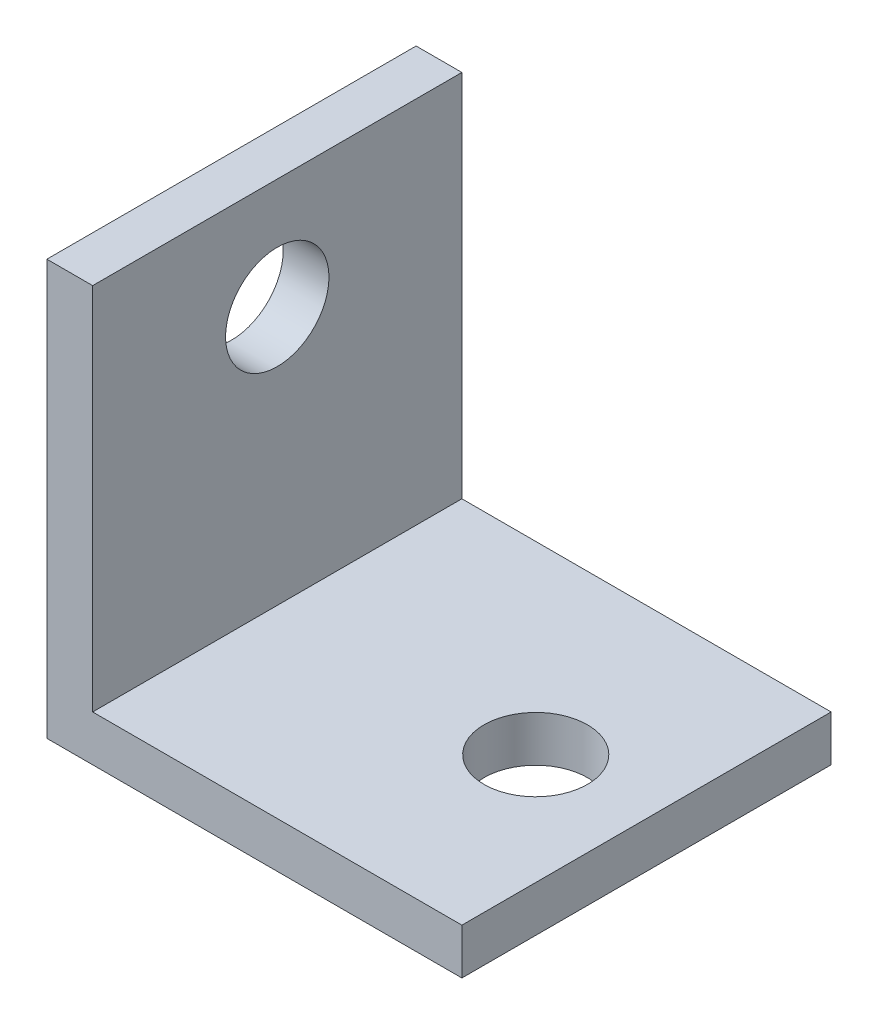
ISO-10303-21;
HEADER;
FILE_DESCRIPTION(('STEP AP214'),'2;1');
FILE_NAME('part.step','',(''),(''),'','','');
FILE_SCHEMA(('AUTOMOTIVE_DESIGN { 1 0 10303 214 1 1 1 1 }'));
ENDSEC;
DATA;
#1=APPLICATION_CONTEXT('core data for automotive mechanical design processes');
#2=APPLICATION_PROTOCOL_DEFINITION('international standard','automotive_design',2000,#1);
#3=PRODUCT_CONTEXT('',#1,'mechanical');
#4=PRODUCT('Part','Part','',(#3));
#5=PRODUCT_RELATED_PRODUCT_CATEGORY('part','',(#4));
#6=PRODUCT_DEFINITION_FORMATION('','',#4);
#7=PRODUCT_DEFINITION_CONTEXT('part definition',#1,'design');
#8=PRODUCT_DEFINITION('design','',#6,#7);
#9=PRODUCT_DEFINITION_SHAPE('','',#8);
#10=(LENGTH_UNIT() NAMED_UNIT(*) SI_UNIT(.MILLI.,.METRE.));
#11=(NAMED_UNIT(*) PLANE_ANGLE_UNIT() SI_UNIT($,.RADIAN.));
#12=(NAMED_UNIT(*) SI_UNIT($,.STERADIAN.) SOLID_ANGLE_UNIT());
#13=UNCERTAINTY_MEASURE_WITH_UNIT(LENGTH_MEASURE(1.E-05),#10,'distance_accuracy_value','');
#14=(GEOMETRIC_REPRESENTATION_CONTEXT(3) GLOBAL_UNCERTAINTY_ASSIGNED_CONTEXT((#13)) GLOBAL_UNIT_ASSIGNED_CONTEXT((#10,
#11,#12)) REPRESENTATION_CONTEXT('',''));
#15=CARTESIAN_POINT('',(0.,0.,0.));
#16=DIRECTION('',(0.,0.,1.));
#17=DIRECTION('',(1.,0.,0.));
#18=AXIS2_PLACEMENT_3D('',#15,#16,#17);
#19=CARTESIAN_POINT('',(0.,1.5748,12.7));
#20=DIRECTION('',(-1.,0.,0.));
#21=DIRECTION('',(0.,0.,1.));
#22=AXIS2_PLACEMENT_3D('',#19,#20,#21);
#23=PLANE('',#22);
#24=DIRECTION('',(0.,1.,0.));
#25=VECTOR('',#24,1.);
#26=CARTESIAN_POINT('',(0.,1.5748,0.));
#27=LINE('',#26,#25);
#28=CARTESIAN_POINT('',(0.,0.,0.));
#29=VERTEX_POINT('',#28);
#30=CARTESIAN_POINT('',(0.,1.5748,0.));
#31=VERTEX_POINT('',#30);
#32=EDGE_CURVE('E87',#29,#31,#27,.T.);
#33=ORIENTED_EDGE('',*,*,#32,.T.);
#34=DIRECTION('',(0.,0.,-1.));
#35=VECTOR('',#34,1.);
#36=CARTESIAN_POINT('',(0.,1.5748,12.7));
#37=LINE('',#36,#35);
#38=CARTESIAN_POINT('',(0.,1.5748,12.7));
#39=VERTEX_POINT('',#38);
#40=EDGE_CURVE('E11',#39,#31,#37,.T.);
#41=ORIENTED_EDGE('',*,*,#40,.F.);
#42=DIRECTION('',(0.,1.,0.));
#43=VECTOR('',#42,1.);
#44=CARTESIAN_POINT('',(0.,1.5748,12.7));
#45=LINE('',#44,#43);
#46=CARTESIAN_POINT('',(0.,0.,12.7));
#47=VERTEX_POINT('',#46);
#48=EDGE_CURVE('E115',#47,#39,#45,.T.);
#49=ORIENTED_EDGE('',*,*,#48,.F.);
#50=DIRECTION('',(0.,0.,-1.));
#51=VECTOR('',#50,1.);
#52=CARTESIAN_POINT('',(0.,0.,12.7));
#53=LINE('',#52,#51);
#54=EDGE_CURVE('E100',#47,#29,#53,.T.);
#55=ORIENTED_EDGE('',*,*,#54,.T.);
#56=EDGE_LOOP('',(#33,#41,#49,#55));
#57=FACE_BOUND('',#56,.T.);
#58=ADVANCED_FACE('F29',(#57),#23,.F.);
#59=CARTESIAN_POINT('',(-12.7,1.5748,12.7));
#60=DIRECTION('',(0.,-1.,0.));
#61=DIRECTION('',(1.,0.,0.));
#62=AXIS2_PLACEMENT_3D('',#59,#60,#61);
#63=PLANE('',#62);
#64=CARTESIAN_POINT('',(-3.81,1.5748,6.35));
#65=DIRECTION('',(0.,1.,0.));
#66=DIRECTION('',(-1.,0.,0.));
#67=AXIS2_PLACEMENT_3D('',#64,#65,#66);
#68=CIRCLE('',#67,1.778);
#69=CARTESIAN_POINT('',(-5.588,1.5748,6.35));
#70=VERTEX_POINT('',#69);
#71=EDGE_CURVE('E231',#70,#70,#68,.T.);
#72=ORIENTED_EDGE('',*,*,#71,.F.);
#73=EDGE_LOOP('',(#72));
#74=FACE_BOUND('',#73,.T.);
#75=DIRECTION('',(-1.,0.,0.));
#76=VECTOR('',#75,1.);
#77=CARTESIAN_POINT('',(-12.7,1.5748,0.));
#78=LINE('',#77,#76);
#79=CARTESIAN_POINT('',(-12.7,1.5748,0.));
#80=VERTEX_POINT('',#79);
#81=EDGE_CURVE('E83',#31,#80,#78,.T.);
#82=ORIENTED_EDGE('',*,*,#81,.T.);
#83=DIRECTION('',(0.,0.,-1.));
#84=VECTOR('',#83,1.);
#85=CARTESIAN_POINT('',(-12.7,1.5748,12.7));
#86=LINE('',#85,#84);
#87=CARTESIAN_POINT('',(-12.7,1.5748,12.7));
#88=VERTEX_POINT('',#87);
#89=EDGE_CURVE('E37',#88,#80,#86,.T.);
#90=ORIENTED_EDGE('',*,*,#89,.F.);
#91=DIRECTION('',(-1.,0.,0.));
#92=VECTOR('',#91,1.);
#93=CARTESIAN_POINT('',(-12.7,1.5748,12.7));
#94=LINE('',#93,#92);
#95=EDGE_CURVE('E96',#39,#88,#94,.T.);
#96=ORIENTED_EDGE('',*,*,#95,.F.);
#97=ORIENTED_EDGE('',*,*,#40,.T.);
#98=EDGE_LOOP('',(#82,#90,#96,#97));
#99=FACE_BOUND('',#98,.T.);
#100=ADVANCED_FACE('F95',(#74,#99),#63,.F.);
#101=CARTESIAN_POINT('',(-12.7,14.2748,12.7));
#102=DIRECTION('',(-1.,0.,0.));
#103=DIRECTION('',(0.,0.,1.));
#104=AXIS2_PLACEMENT_3D('',#101,#102,#103);
#105=PLANE('',#104);
#106=CARTESIAN_POINT('',(-12.7,10.4648,6.35));
#107=DIRECTION('',(1.,0.,0.));
#108=DIRECTION('',(0.,0.,-1.));
#109=AXIS2_PLACEMENT_3D('',#106,#107,#108);
#110=CIRCLE('',#109,1.778);
#111=CARTESIAN_POINT('',(-12.7,10.4648,4.572));
#112=VERTEX_POINT('',#111);
#113=EDGE_CURVE('E104',#112,#112,#110,.T.);
#114=ORIENTED_EDGE('',*,*,#113,.F.);
#115=EDGE_LOOP('',(#114));
#116=FACE_BOUND('',#115,.T.);
#117=DIRECTION('',(0.,1.,0.));
#118=VECTOR('',#117,1.);
#119=CARTESIAN_POINT('',(-12.7,14.2748,0.));
#120=LINE('',#119,#118);
#121=CARTESIAN_POINT('',(-12.7,14.2748,0.));
#122=VERTEX_POINT('',#121);
#123=EDGE_CURVE('E89',#80,#122,#120,.T.);
#124=ORIENTED_EDGE('',*,*,#123,.T.);
#125=DIRECTION('',(0.,0.,-1.));
#126=VECTOR('',#125,1.);
#127=CARTESIAN_POINT('',(-12.7,14.2748,12.7));
#128=LINE('',#127,#126);
#129=CARTESIAN_POINT('',(-12.7,14.2748,12.7));
#130=VERTEX_POINT('',#129);
#131=EDGE_CURVE('E131',#130,#122,#128,.T.);
#132=ORIENTED_EDGE('',*,*,#131,.F.);
#133=DIRECTION('',(0.,1.,0.));
#134=VECTOR('',#133,1.);
#135=CARTESIAN_POINT('',(-12.7,14.2748,12.7));
#136=LINE('',#135,#134);
#137=EDGE_CURVE('E118',#88,#130,#136,.T.);
#138=ORIENTED_EDGE('',*,*,#137,.F.);
#139=ORIENTED_EDGE('',*,*,#89,.T.);
#140=EDGE_LOOP('',(#124,#132,#138,#139));
#141=FACE_BOUND('',#140,.T.);
#142=ADVANCED_FACE('F136',(#116,#141),#105,.F.);
#143=CARTESIAN_POINT('',(-14.2748,14.2748,12.7));
#144=DIRECTION('',(0.,-1.,0.));
#145=DIRECTION('',(0.,0.,-1.));
#146=AXIS2_PLACEMENT_3D('',#143,#144,#145);
#147=PLANE('',#146);
#148=DIRECTION('',(-1.,0.,0.));
#149=VECTOR('',#148,1.);
#150=CARTESIAN_POINT('',(-14.2748,14.2748,0.));
#151=LINE('',#150,#149);
#152=CARTESIAN_POINT('',(-14.2748,14.2748,0.));
#153=VERTEX_POINT('',#152);
#154=EDGE_CURVE('E109',#122,#153,#151,.T.);
#155=ORIENTED_EDGE('',*,*,#154,.T.);
#156=DIRECTION('',(0.,0.,-1.));
#157=VECTOR('',#156,1.);
#158=CARTESIAN_POINT('',(-14.2748,14.2748,12.7));
#159=LINE('',#158,#157);
#160=CARTESIAN_POINT('',(-14.2748,14.2748,12.7));
#161=VERTEX_POINT('',#160);
#162=EDGE_CURVE('E128',#161,#153,#159,.T.);
#163=ORIENTED_EDGE('',*,*,#162,.F.);
#164=DIRECTION('',(-1.,0.,0.));
#165=VECTOR('',#164,1.);
#166=CARTESIAN_POINT('',(-14.2748,14.2748,12.7));
#167=LINE('',#166,#165);
#168=EDGE_CURVE('E120',#130,#161,#167,.T.);
#169=ORIENTED_EDGE('',*,*,#168,.F.);
#170=ORIENTED_EDGE('',*,*,#131,.T.);
#171=EDGE_LOOP('',(#155,#163,#169,#170));
#172=FACE_BOUND('',#171,.T.);
#173=ADVANCED_FACE('F142',(#172),#147,.F.);
#174=CARTESIAN_POINT('',(-14.2748,0.,12.7));
#175=DIRECTION('',(1.,0.,0.));
#176=DIRECTION('',(0.,0.,-1.));
#177=AXIS2_PLACEMENT_3D('',#174,#175,#176);
#178=PLANE('',#177);
#179=CARTESIAN_POINT('',(-14.2748,10.4648,6.35));
#180=DIRECTION('',(1.,0.,0.));
#181=DIRECTION('',(0.,0.,-1.));
#182=AXIS2_PLACEMENT_3D('',#179,#180,#181);
#183=CIRCLE('',#182,1.778);
#184=CARTESIAN_POINT('',(-14.2748,10.4648,4.572));
#185=VERTEX_POINT('',#184);
#186=EDGE_CURVE('E101',#185,#185,#183,.T.);
#187=ORIENTED_EDGE('',*,*,#186,.T.);
#188=EDGE_LOOP('',(#187));
#189=FACE_BOUND('',#188,.T.);
#190=DIRECTION('',(0.,-1.,0.));
#191=VECTOR('',#190,1.);
#192=CARTESIAN_POINT('',(-14.2748,0.,0.));
#193=LINE('',#192,#191);
#194=CARTESIAN_POINT('',(-14.2748,0.,0.));
#195=VERTEX_POINT('',#194);
#196=EDGE_CURVE('E111',#153,#195,#193,.T.);
#197=ORIENTED_EDGE('',*,*,#196,.T.);
#198=DIRECTION('',(0.,0.,-1.));
#199=VECTOR('',#198,1.);
#200=CARTESIAN_POINT('',(-14.2748,0.,12.7));
#201=LINE('',#200,#199);
#202=CARTESIAN_POINT('',(-14.2748,0.,12.7));
#203=VERTEX_POINT('',#202);
#204=EDGE_CURVE('E125',#203,#195,#201,.T.);
#205=ORIENTED_EDGE('',*,*,#204,.F.);
#206=DIRECTION('',(0.,-1.,0.));
#207=VECTOR('',#206,1.);
#208=CARTESIAN_POINT('',(-14.2748,0.,12.7));
#209=LINE('',#208,#207);
#210=EDGE_CURVE('E50',#161,#203,#209,.T.);
#211=ORIENTED_EDGE('',*,*,#210,.F.);
#212=ORIENTED_EDGE('',*,*,#162,.T.);
#213=EDGE_LOOP('',(#197,#205,#211,#212));
#214=FACE_BOUND('',#213,.T.);
#215=ADVANCED_FACE('F145',(#189,#214),#178,.F.);
#216=CARTESIAN_POINT('',(0.,0.,12.7));
#217=DIRECTION('',(0.,1.,0.));
#218=DIRECTION('',(-1.,0.,0.));
#219=AXIS2_PLACEMENT_3D('',#216,#217,#218);
#220=PLANE('',#219);
#221=CARTESIAN_POINT('',(-3.81,0.,6.35));
#222=DIRECTION('',(0.,1.,0.));
#223=DIRECTION('',(-1.,0.,0.));
#224=AXIS2_PLACEMENT_3D('',#221,#222,#223);
#225=CIRCLE('',#224,1.778);
#226=CARTESIAN_POINT('',(-5.588,0.,6.35));
#227=VERTEX_POINT('',#226);
#228=EDGE_CURVE('E32',#227,#227,#225,.T.);
#229=ORIENTED_EDGE('',*,*,#228,.T.);
#230=EDGE_LOOP('',(#229));
#231=FACE_BOUND('',#230,.T.);
#232=DIRECTION('',(1.,0.,0.));
#233=VECTOR('',#232,1.);
#234=CARTESIAN_POINT('',(0.,0.,0.));
#235=LINE('',#234,#233);
#236=EDGE_CURVE('E113',#195,#29,#235,.T.);
#237=ORIENTED_EDGE('',*,*,#236,.T.);
#238=ORIENTED_EDGE('',*,*,#54,.F.);
#239=DIRECTION('',(1.,0.,0.));
#240=VECTOR('',#239,1.);
#241=CARTESIAN_POINT('',(0.,0.,12.7));
#242=LINE('',#241,#240);
#243=EDGE_CURVE('E45',#203,#47,#242,.T.);
#244=ORIENTED_EDGE('',*,*,#243,.F.);
#245=ORIENTED_EDGE('',*,*,#204,.T.);
#246=EDGE_LOOP('',(#237,#238,#244,#245));
#247=FACE_BOUND('',#246,.T.);
#248=ADVANCED_FACE('F147',(#231,#247),#220,.F.);
#249=CARTESIAN_POINT('',(0.,14.2748,12.7));
#250=DIRECTION('',(0.,0.,1.));
#251=DIRECTION('',(1.,0.,0.));
#252=AXIS2_PLACEMENT_3D('',#249,#250,#251);
#253=PLANE('',#252);
#254=ORIENTED_EDGE('',*,*,#48,.T.);
#255=ORIENTED_EDGE('',*,*,#95,.T.);
#256=ORIENTED_EDGE('',*,*,#137,.T.);
#257=ORIENTED_EDGE('',*,*,#168,.T.);
#258=ORIENTED_EDGE('',*,*,#210,.T.);
#259=ORIENTED_EDGE('',*,*,#243,.T.);
#260=EDGE_LOOP('',(#254,#255,#256,#257,#258,#259));
#261=FACE_BOUND('',#260,.T.);
#262=ADVANCED_FACE('F139',(#261),#253,.T.);
#263=CARTESIAN_POINT('',(0.,14.2748,0.));
#264=DIRECTION('',(0.,0.,1.));
#265=DIRECTION('',(1.,0.,0.));
#266=AXIS2_PLACEMENT_3D('',#263,#264,#265);
#267=PLANE('',#266);
#268=ORIENTED_EDGE('',*,*,#32,.F.);
#269=ORIENTED_EDGE('',*,*,#236,.F.);
#270=ORIENTED_EDGE('',*,*,#196,.F.);
#271=ORIENTED_EDGE('',*,*,#154,.F.);
#272=ORIENTED_EDGE('',*,*,#123,.F.);
#273=ORIENTED_EDGE('',*,*,#81,.F.);
#274=EDGE_LOOP('',(#268,#269,#270,#271,#272,#273));
#275=FACE_BOUND('',#274,.T.);
#276=ADVANCED_FACE('F84',(#275),#267,.F.);
#277=CARTESIAN_POINT('',(-19.8374,10.4648,6.35));
#278=DIRECTION('',(1.,0.,0.));
#279=DIRECTION('',(0.,0.,-1.));
#280=AXIS2_PLACEMENT_3D('',#277,#278,#279);
#281=CYLINDRICAL_SURFACE('',#280,1.778);
#282=ORIENTED_EDGE('',*,*,#113,.T.);
#283=EDGE_LOOP('',(#282));
#284=FACE_BOUND('',#283,.T.);
#285=ORIENTED_EDGE('',*,*,#186,.F.);
#286=EDGE_LOOP('',(#285));
#287=FACE_BOUND('',#286,.T.);
#288=ADVANCED_FACE('F190',(#284,#287),#281,.F.);
#289=CARTESIAN_POINT('',(-3.81,-5.5626,6.35));
#290=DIRECTION('',(0.,1.,0.));
#291=DIRECTION('',(-1.,0.,0.));
#292=AXIS2_PLACEMENT_3D('',#289,#290,#291);
#293=CYLINDRICAL_SURFACE('',#292,1.778);
#294=ORIENTED_EDGE('',*,*,#71,.T.);
#295=EDGE_LOOP('',(#294));
#296=FACE_BOUND('',#295,.T.);
#297=ORIENTED_EDGE('',*,*,#228,.F.);
#298=EDGE_LOOP('',(#297));
#299=FACE_BOUND('',#298,.T.);
#300=ADVANCED_FACE('F194',(#296,#299),#293,.F.);
#301=CLOSED_SHELL('',(#58,#100,#142,#173,#215,#248,#262,#276,#288,#300));
#302=MANIFOLD_SOLID_BREP('B2',#301);
#303=ADVANCED_BREP_SHAPE_REPRESENTATION('',(#18,#302),#14);
#304=SHAPE_DEFINITION_REPRESENTATION(#9,#303);
ENDSEC;
END-ISO-10303-21;
